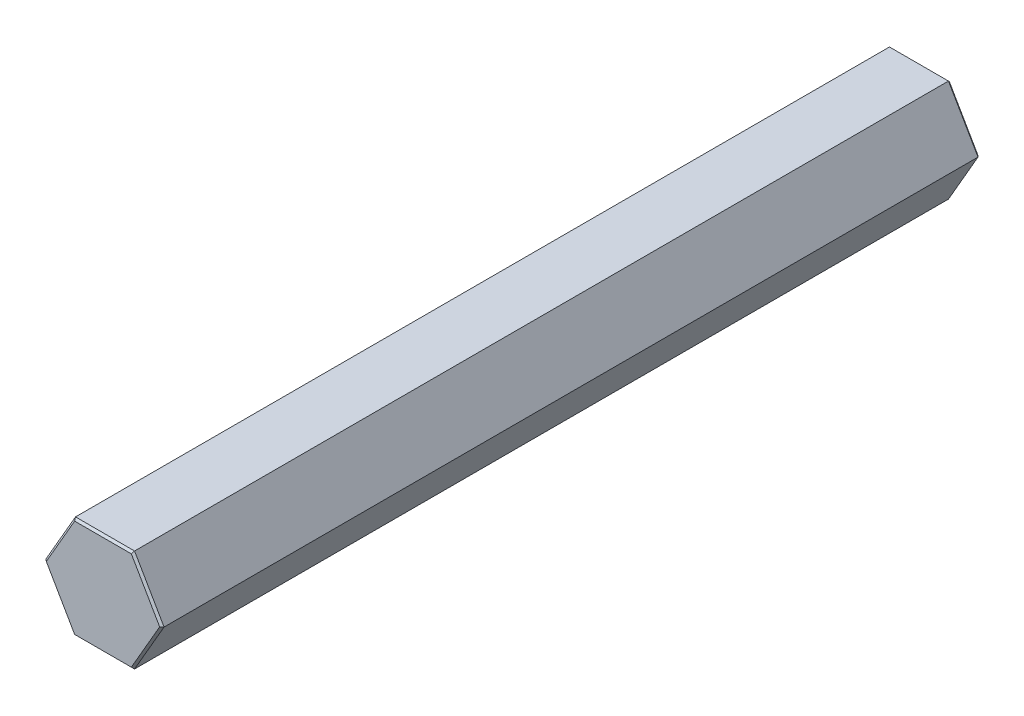
ISO-10303-21;
HEADER;
FILE_DESCRIPTION(('STEP AP214'),'2;1');
FILE_NAME('part.step','',(''),(''),'','','');
FILE_SCHEMA(('AUTOMOTIVE_DESIGN { 1 0 10303 214 1 1 1 1 }'));
ENDSEC;
DATA;
#1=APPLICATION_CONTEXT('core data for automotive mechanical design processes');
#2=APPLICATION_PROTOCOL_DEFINITION('international standard','automotive_design',2000,#1);
#3=PRODUCT_CONTEXT('',#1,'mechanical');
#4=PRODUCT('Part','Part','',(#3));
#5=PRODUCT_RELATED_PRODUCT_CATEGORY('part','',(#4));
#6=PRODUCT_DEFINITION_FORMATION('','',#4);
#7=PRODUCT_DEFINITION_CONTEXT('part definition',#1,'design');
#8=PRODUCT_DEFINITION('design','',#6,#7);
#9=PRODUCT_DEFINITION_SHAPE('','',#8);
#10=(LENGTH_UNIT() NAMED_UNIT(*) SI_UNIT(.MILLI.,.METRE.));
#11=(NAMED_UNIT(*) PLANE_ANGLE_UNIT() SI_UNIT($,.RADIAN.));
#12=(NAMED_UNIT(*) SI_UNIT($,.STERADIAN.) SOLID_ANGLE_UNIT());
#13=UNCERTAINTY_MEASURE_WITH_UNIT(LENGTH_MEASURE(1.E-05),#10,'distance_accuracy_value','');
#14=(GEOMETRIC_REPRESENTATION_CONTEXT(3) GLOBAL_UNCERTAINTY_ASSIGNED_CONTEXT((#13)) GLOBAL_UNIT_ASSIGNED_CONTEXT((#10,
#11,#12)) REPRESENTATION_CONTEXT('',''));
#15=CARTESIAN_POINT('',(0.,0.,0.));
#16=DIRECTION('',(0.,0.,1.));
#17=DIRECTION('',(1.,0.,0.));
#18=AXIS2_PLACEMENT_3D('',#15,#16,#17);
#19=CARTESIAN_POINT('',(-7.33234841870824,0.,101.6));
#20=DIRECTION('',(-0.866025403784439,0.5,0.));
#21=DIRECTION('',(-0.5,-0.866025403784439,0.));
#22=AXIS2_PLACEMENT_3D('',#19,#20,#21);
#23=PLANE('',#22);
#24=DIRECTION('',(0.,0.,-1.));
#25=VECTOR('',#24,1.);
#26=CARTESIAN_POINT('',(-3.66617420935412,6.35,101.6));
#27=LINE('',#26,#25);
#28=CARTESIAN_POINT('',(-3.66617420935412,6.35,101.346));
#29=VERTEX_POINT('',#28);
#30=CARTESIAN_POINT('',(-3.66617420935412,6.35,0.254000000000032));
#31=VERTEX_POINT('',#30);
#32=EDGE_CURVE('E158',#29,#31,#27,.T.);
#33=ORIENTED_EDGE('',*,*,#32,.T.);
#34=DIRECTION('',(-0.5,-0.866025403784439,0.));
#35=VECTOR('',#34,1.);
#36=CARTESIAN_POINT('',(-7.33234841870824,0.,0.254000000000032));
#37=LINE('',#36,#35);
#38=CARTESIAN_POINT('',(-7.33234841870824,0.,0.254000000000032));
#39=VERTEX_POINT('',#38);
#40=EDGE_CURVE('E155',#31,#39,#37,.T.);
#41=ORIENTED_EDGE('',*,*,#40,.T.);
#42=DIRECTION('',(0.,0.,-1.));
#43=VECTOR('',#42,1.);
#44=CARTESIAN_POINT('',(-7.33234841870824,0.,101.6));
#45=LINE('',#44,#43);
#46=CARTESIAN_POINT('',(-7.33234841870824,0.,101.346));
#47=VERTEX_POINT('',#46);
#48=EDGE_CURVE('E152',#47,#39,#45,.T.);
#49=ORIENTED_EDGE('',*,*,#48,.F.);
#50=DIRECTION('',(0.5,0.866025403784439,0.));
#51=VECTOR('',#50,1.);
#52=CARTESIAN_POINT('',(-3.66617420935412,6.35,101.346));
#53=LINE('',#52,#51);
#54=EDGE_CURVE('E212',#47,#29,#53,.T.);
#55=ORIENTED_EDGE('',*,*,#54,.T.);
#56=EDGE_LOOP('',(#33,#41,#49,#55));
#57=FACE_BOUND('',#56,.T.);
#58=ADVANCED_FACE('F37',(#57),#23,.T.);
#59=CARTESIAN_POINT('',(-3.66617420935412,-6.35,101.6));
#60=DIRECTION('',(-0.866025403784439,-0.5,0.));
#61=DIRECTION('',(0.5,-0.866025403784439,0.));
#62=AXIS2_PLACEMENT_3D('',#59,#60,#61);
#63=PLANE('',#62);
#64=ORIENTED_EDGE('',*,*,#48,.T.);
#65=DIRECTION('',(0.5,-0.866025403784439,0.));
#66=VECTOR('',#65,1.);
#67=CARTESIAN_POINT('',(-3.66617420935412,-6.35,0.254000000000032));
#68=LINE('',#67,#66);
#69=CARTESIAN_POINT('',(-3.66617420935412,-6.35,0.254000000000032));
#70=VERTEX_POINT('',#69);
#71=EDGE_CURVE('E196',#39,#70,#68,.T.);
#72=ORIENTED_EDGE('',*,*,#71,.T.);
#73=DIRECTION('',(0.,0.,-1.));
#74=VECTOR('',#73,1.);
#75=CARTESIAN_POINT('',(-3.66617420935412,-6.35,101.6));
#76=LINE('',#75,#74);
#77=CARTESIAN_POINT('',(-3.66617420935412,-6.35,101.346));
#78=VERTEX_POINT('',#77);
#79=EDGE_CURVE('E275',#78,#70,#76,.T.);
#80=ORIENTED_EDGE('',*,*,#79,.F.);
#81=DIRECTION('',(-0.5,0.866025403784439,0.));
#82=VECTOR('',#81,1.);
#83=CARTESIAN_POINT('',(-7.33234841870824,0.,101.346));
#84=LINE('',#83,#82);
#85=EDGE_CURVE('E202',#78,#47,#84,.T.);
#86=ORIENTED_EDGE('',*,*,#85,.T.);
#87=EDGE_LOOP('',(#64,#72,#80,#86));
#88=FACE_BOUND('',#87,.T.);
#89=ADVANCED_FACE('F278',(#88),#63,.T.);
#90=CARTESIAN_POINT('',(3.66617420935413,-6.35,101.6));
#91=DIRECTION('',(0.,-1.,0.));
#92=DIRECTION('',(0.,0.,-1.));
#93=AXIS2_PLACEMENT_3D('',#90,#91,#92);
#94=PLANE('',#93);
#95=ORIENTED_EDGE('',*,*,#79,.T.);
#96=DIRECTION('',(1.,0.,0.));
#97=VECTOR('',#96,1.);
#98=CARTESIAN_POINT('',(3.66617420935413,-6.35,0.254000000000032));
#99=LINE('',#98,#97);
#100=CARTESIAN_POINT('',(3.66617420935413,-6.35,0.254000000000032));
#101=VERTEX_POINT('',#100);
#102=EDGE_CURVE('E235',#70,#101,#99,.T.);
#103=ORIENTED_EDGE('',*,*,#102,.T.);
#104=DIRECTION('',(0.,0.,-1.));
#105=VECTOR('',#104,1.);
#106=CARTESIAN_POINT('',(3.66617420935413,-6.35,101.6));
#107=LINE('',#106,#105);
#108=CARTESIAN_POINT('',(3.66617420935413,-6.35,101.346));
#109=VERTEX_POINT('',#108);
#110=EDGE_CURVE('E252',#109,#101,#107,.T.);
#111=ORIENTED_EDGE('',*,*,#110,.F.);
#112=DIRECTION('',(-1.,0.,0.));
#113=VECTOR('',#112,1.);
#114=CARTESIAN_POINT('',(-3.66617420935412,-6.35,101.346));
#115=LINE('',#114,#113);
#116=EDGE_CURVE('E232',#109,#78,#115,.T.);
#117=ORIENTED_EDGE('',*,*,#116,.T.);
#118=EDGE_LOOP('',(#95,#103,#111,#117));
#119=FACE_BOUND('',#118,.T.);
#120=ADVANCED_FACE('F303',(#119),#94,.T.);
#121=CARTESIAN_POINT('',(7.33234841870825,0.,101.6));
#122=DIRECTION('',(0.866025403784439,-0.5,0.));
#123=DIRECTION('',(0.5,0.866025403784439,0.));
#124=AXIS2_PLACEMENT_3D('',#121,#122,#123);
#125=PLANE('',#124);
#126=ORIENTED_EDGE('',*,*,#110,.T.);
#127=DIRECTION('',(0.5,0.866025403784439,0.));
#128=VECTOR('',#127,1.);
#129=CARTESIAN_POINT('',(7.33234841870825,0.,0.254000000000032));
#130=LINE('',#129,#128);
#131=CARTESIAN_POINT('',(7.33234841870825,0.,0.254000000000032));
#132=VERTEX_POINT('',#131);
#133=EDGE_CURVE('E207',#101,#132,#130,.T.);
#134=ORIENTED_EDGE('',*,*,#133,.T.);
#135=DIRECTION('',(0.,0.,-1.));
#136=VECTOR('',#135,1.);
#137=CARTESIAN_POINT('',(7.33234841870825,0.,101.6));
#138=LINE('',#137,#136);
#139=CARTESIAN_POINT('',(7.33234841870825,0.,101.346));
#140=VERTEX_POINT('',#139);
#141=EDGE_CURVE('E251',#140,#132,#138,.T.);
#142=ORIENTED_EDGE('',*,*,#141,.F.);
#143=DIRECTION('',(-0.5,-0.866025403784439,0.));
#144=VECTOR('',#143,1.);
#145=CARTESIAN_POINT('',(3.66617420935413,-6.35,101.346));
#146=LINE('',#145,#144);
#147=EDGE_CURVE('E239',#140,#109,#146,.T.);
#148=ORIENTED_EDGE('',*,*,#147,.T.);
#149=EDGE_LOOP('',(#126,#134,#142,#148));
#150=FACE_BOUND('',#149,.T.);
#151=ADVANCED_FACE('F250',(#150),#125,.T.);
#152=CARTESIAN_POINT('',(3.66617420935413,6.35,101.6));
#153=DIRECTION('',(0.866025403784439,0.5,0.));
#154=DIRECTION('',(-0.5,0.866025403784439,0.));
#155=AXIS2_PLACEMENT_3D('',#152,#153,#154);
#156=PLANE('',#155);
#157=ORIENTED_EDGE('',*,*,#141,.T.);
#158=DIRECTION('',(-0.5,0.866025403784439,0.));
#159=VECTOR('',#158,1.);
#160=CARTESIAN_POINT('',(3.66617420935413,6.35,0.254000000000032));
#161=LINE('',#160,#159);
#162=CARTESIAN_POINT('',(3.66617420935413,6.35,0.254000000000032));
#163=VERTEX_POINT('',#162);
#164=EDGE_CURVE('E204',#132,#163,#161,.T.);
#165=ORIENTED_EDGE('',*,*,#164,.T.);
#166=DIRECTION('',(0.,0.,-1.));
#167=VECTOR('',#166,1.);
#168=CARTESIAN_POINT('',(3.66617420935413,6.35,101.6));
#169=LINE('',#168,#167);
#170=CARTESIAN_POINT('',(3.66617420935413,6.35,101.346));
#171=VERTEX_POINT('',#170);
#172=EDGE_CURVE('E261',#171,#163,#169,.T.);
#173=ORIENTED_EDGE('',*,*,#172,.F.);
#174=DIRECTION('',(0.5,-0.866025403784439,0.));
#175=VECTOR('',#174,1.);
#176=CARTESIAN_POINT('',(7.33234841870825,0.,101.346));
#177=LINE('',#176,#175);
#178=EDGE_CURVE('E201',#171,#140,#177,.T.);
#179=ORIENTED_EDGE('',*,*,#178,.T.);
#180=EDGE_LOOP('',(#157,#165,#173,#179));
#181=FACE_BOUND('',#180,.T.);
#182=ADVANCED_FACE('F257',(#181),#156,.T.);
#183=CARTESIAN_POINT('',(-3.66617420935412,6.35,101.6));
#184=DIRECTION('',(0.,1.,0.));
#185=DIRECTION('',(0.,0.,1.));
#186=AXIS2_PLACEMENT_3D('',#183,#184,#185);
#187=PLANE('',#186);
#188=ORIENTED_EDGE('',*,*,#172,.T.);
#189=DIRECTION('',(-1.,0.,0.));
#190=VECTOR('',#189,1.);
#191=CARTESIAN_POINT('',(-3.66617420935412,6.35,0.254000000000032));
#192=LINE('',#191,#190);
#193=EDGE_CURVE('E217',#163,#31,#192,.T.);
#194=ORIENTED_EDGE('',*,*,#193,.T.);
#195=ORIENTED_EDGE('',*,*,#32,.F.);
#196=DIRECTION('',(1.,0.,0.));
#197=VECTOR('',#196,1.);
#198=CARTESIAN_POINT('',(3.66617420935413,6.35,101.346));
#199=LINE('',#198,#197);
#200=EDGE_CURVE('E215',#29,#171,#199,.T.);
#201=ORIENTED_EDGE('',*,*,#200,.T.);
#202=EDGE_LOOP('',(#188,#194,#195,#201));
#203=FACE_BOUND('',#202,.T.);
#204=ADVANCED_FACE('F283',(#203),#187,.T.);
#205=CARTESIAN_POINT('',(0.,0.,101.6));
#206=DIRECTION('',(0.,0.,-1.));
#207=DIRECTION('',(-1.,0.,0.));
#208=AXIS2_PLACEMENT_3D('',#205,#206,#207);
#209=PLANE('',#208);
#210=DIRECTION('',(-0.5,-0.866025403784439,0.));
#211=VECTOR('',#210,1.);
#212=CARTESIAN_POINT('',(-7.11237796614699,-0.127000000000001,101.6));
#213=LINE('',#212,#211);
#214=CARTESIAN_POINT('',(-3.51952724097995,6.09599999999999,101.6));
#215=VERTEX_POINT('',#214);
#216=CARTESIAN_POINT('',(-7.03905448195991,0.,101.6));
#217=VERTEX_POINT('',#216);
#218=EDGE_CURVE('E62',#215,#217,#213,.T.);
#219=ORIENTED_EDGE('',*,*,#218,.T.);
#220=DIRECTION('',(0.5,-0.866025403784439,0.));
#221=VECTOR('',#220,1.);
#222=CARTESIAN_POINT('',(-3.44620375679287,-6.223,101.6));
#223=LINE('',#222,#221);
#224=CARTESIAN_POINT('',(-3.51952724097995,-6.09599999999999,101.6));
#225=VERTEX_POINT('',#224);
#226=EDGE_CURVE('E11',#217,#225,#223,.T.);
#227=ORIENTED_EDGE('',*,*,#226,.T.);
#228=DIRECTION('',(1.,0.,0.));
#229=VECTOR('',#228,1.);
#230=CARTESIAN_POINT('',(3.66617420935413,-6.09599999999999,101.6));
#231=LINE('',#230,#229);
#232=CARTESIAN_POINT('',(3.51952724097996,-6.09599999999999,101.6));
#233=VERTEX_POINT('',#232);
#234=EDGE_CURVE('E47',#225,#233,#231,.T.);
#235=ORIENTED_EDGE('',*,*,#234,.T.);
#236=DIRECTION('',(0.5,0.866025403784439,0.));
#237=VECTOR('',#236,1.);
#238=CARTESIAN_POINT('',(7.112377966147,0.127000000000007,101.6));
#239=LINE('',#238,#237);
#240=CARTESIAN_POINT('',(7.03905448195991,0.,101.6));
#241=VERTEX_POINT('',#240);
#242=EDGE_CURVE('E223',#233,#241,#239,.T.);
#243=ORIENTED_EDGE('',*,*,#242,.T.);
#244=DIRECTION('',(-0.5,0.866025403784439,0.));
#245=VECTOR('',#244,1.);
#246=CARTESIAN_POINT('',(3.44620375679288,6.223,101.6));
#247=LINE('',#246,#245);
#248=CARTESIAN_POINT('',(3.51952724097996,6.09599999999999,101.6));
#249=VERTEX_POINT('',#248);
#250=EDGE_CURVE('E219',#241,#249,#247,.T.);
#251=ORIENTED_EDGE('',*,*,#250,.T.);
#252=DIRECTION('',(-1.,0.,0.));
#253=VECTOR('',#252,1.);
#254=CARTESIAN_POINT('',(-3.66617420935412,6.09599999999999,101.6));
#255=LINE('',#254,#253);
#256=EDGE_CURVE('E221',#249,#215,#255,.T.);
#257=ORIENTED_EDGE('',*,*,#256,.T.);
#258=EDGE_LOOP('',(#219,#227,#235,#243,#251,#257));
#259=FACE_BOUND('',#258,.T.);
#260=ADVANCED_FACE('F225',(#259),#209,.F.);
#261=CARTESIAN_POINT('',(0.,0.,0.));
#262=DIRECTION('',(0.,0.,-1.));
#263=DIRECTION('',(-1.,0.,0.));
#264=AXIS2_PLACEMENT_3D('',#261,#262,#263);
#265=PLANE('',#264);
#266=DIRECTION('',(-0.5,-0.866025403784439,0.));
#267=VECTOR('',#266,1.);
#268=CARTESIAN_POINT('',(5.27929086146991,-3.04799999999998,0.));
#269=LINE('',#268,#267);
#270=CARTESIAN_POINT('',(7.03905448195988,0.,0.));
#271=VERTEX_POINT('',#270);
#272=CARTESIAN_POINT('',(3.51952724097994,-6.09599999999997,0.));
#273=VERTEX_POINT('',#272);
#274=EDGE_CURVE('E241',#271,#273,#269,.T.);
#275=ORIENTED_EDGE('',*,*,#274,.T.);
#276=DIRECTION('',(-1.,0.,0.));
#277=VECTOR('',#276,1.);
#278=CARTESIAN_POINT('',(0.,-6.09599999999997,0.));
#279=LINE('',#278,#277);
#280=CARTESIAN_POINT('',(-3.51952724097993,-6.09599999999997,0.));
#281=VERTEX_POINT('',#280);
#282=EDGE_CURVE('E236',#273,#281,#279,.T.);
#283=ORIENTED_EDGE('',*,*,#282,.T.);
#284=DIRECTION('',(-0.5,0.866025403784439,0.));
#285=VECTOR('',#284,1.);
#286=CARTESIAN_POINT('',(-5.27929086146991,-3.04799999999998,0.));
#287=LINE('',#286,#285);
#288=CARTESIAN_POINT('',(-7.03905448195987,0.,0.));
#289=VERTEX_POINT('',#288);
#290=EDGE_CURVE('E136',#281,#289,#287,.T.);
#291=ORIENTED_EDGE('',*,*,#290,.T.);
#292=DIRECTION('',(0.5,0.866025403784439,0.));
#293=VECTOR('',#292,1.);
#294=CARTESIAN_POINT('',(-5.27929086146991,3.04799999999998,0.));
#295=LINE('',#294,#293);
#296=CARTESIAN_POINT('',(-3.51952724097994,6.09599999999997,0.));
#297=VERTEX_POINT('',#296);
#298=EDGE_CURVE('E129',#289,#297,#295,.T.);
#299=ORIENTED_EDGE('',*,*,#298,.T.);
#300=DIRECTION('',(1.,0.,0.));
#301=VECTOR('',#300,1.);
#302=CARTESIAN_POINT('',(0.,6.09599999999997,0.));
#303=LINE('',#302,#301);
#304=CARTESIAN_POINT('',(3.51952724097995,6.09599999999997,0.));
#305=VERTEX_POINT('',#304);
#306=EDGE_CURVE('E132',#297,#305,#303,.T.);
#307=ORIENTED_EDGE('',*,*,#306,.T.);
#308=DIRECTION('',(0.5,-0.866025403784439,0.));
#309=VECTOR('',#308,1.);
#310=CARTESIAN_POINT('',(5.27929086146991,3.04799999999998,0.));
#311=LINE('',#310,#309);
#312=EDGE_CURVE('E141',#305,#271,#311,.T.);
#313=ORIENTED_EDGE('',*,*,#312,.T.);
#314=EDGE_LOOP('',(#275,#283,#291,#299,#307,#313));
#315=FACE_BOUND('',#314,.T.);
#316=ADVANCED_FACE('F131',(#315),#265,.T.);
#317=CARTESIAN_POINT('',(0.,6.09599999999997,0.));
#318=DIRECTION('',(0.,-0.707106781186547,0.707106781186547));
#319=DIRECTION('',(1.,0.,0.));
#320=AXIS2_PLACEMENT_3D('',#317,#318,#319);
#321=PLANE('',#320);
#322=DIRECTION('',(-0.377964473009225,0.654653670707978,0.654653670707978));
#323=VECTOR('',#322,1.);
#324=CARTESIAN_POINT('',(-3.01673763512566,5.22514285714283,-0.870857142857133));
#325=LINE('',#324,#323);
#326=EDGE_CURVE('E147',#31,#297,#325,.F.);
#327=ORIENTED_EDGE('',*,*,#326,.F.);
#328=ORIENTED_EDGE('',*,*,#193,.F.);
#329=DIRECTION('',(-0.377964473009227,-0.654653670707977,-0.654653670707977));
#330=VECTOR('',#329,1.);
#331=CARTESIAN_POINT('',(3.01673763512567,5.22514285714283,-0.870857142857139));
#332=LINE('',#331,#330);
#333=EDGE_CURVE('E150',#305,#163,#332,.F.);
#334=ORIENTED_EDGE('',*,*,#333,.F.);
#335=ORIENTED_EDGE('',*,*,#306,.F.);
#336=EDGE_LOOP('',(#327,#328,#334,#335));
#337=FACE_BOUND('',#336,.T.);
#338=ADVANCED_FACE('F145',(#337),#321,.F.);
#339=CARTESIAN_POINT('',(5.27929086146991,3.04799999999999,0.));
#340=DIRECTION('',(-0.612372435695795,-0.353553390593274,0.707106781186547));
#341=DIRECTION('',(0.5,-0.866025403784439,0.));
#342=AXIS2_PLACEMENT_3D('',#339,#340,#341);
#343=PLANE('',#342);
#344=ORIENTED_EDGE('',*,*,#333,.T.);
#345=ORIENTED_EDGE('',*,*,#164,.F.);
#346=DIRECTION('',(-0.755928946018455,0.,-0.654653670707976));
#347=VECTOR('',#346,1.);
#348=CARTESIAN_POINT('',(6.03347527025132,0.,-0.870857142857144));
#349=LINE('',#348,#347);
#350=EDGE_CURVE('E156',#271,#132,#349,.F.);
#351=ORIENTED_EDGE('',*,*,#350,.F.);
#352=ORIENTED_EDGE('',*,*,#312,.F.);
#353=EDGE_LOOP('',(#344,#345,#351,#352));
#354=FACE_BOUND('',#353,.T.);
#355=ADVANCED_FACE('F265',(#354),#343,.F.);
#356=CARTESIAN_POINT('',(-5.27929086146991,3.04799999999998,0.));
#357=DIRECTION('',(0.612372435695795,-0.353553390593274,0.707106781186546));
#358=DIRECTION('',(0.5,0.866025403784439,0.));
#359=AXIS2_PLACEMENT_3D('',#356,#357,#358);
#360=PLANE('',#359);
#361=ORIENTED_EDGE('',*,*,#326,.T.);
#362=ORIENTED_EDGE('',*,*,#298,.F.);
#363=DIRECTION('',(-0.755928946018454,0.,0.654653670707978));
#364=VECTOR('',#363,1.);
#365=CARTESIAN_POINT('',(-6.03347527025132,0.,-0.87085714285714));
#366=LINE('',#365,#364);
#367=EDGE_CURVE('E161',#39,#289,#366,.F.);
#368=ORIENTED_EDGE('',*,*,#367,.F.);
#369=ORIENTED_EDGE('',*,*,#40,.F.);
#370=EDGE_LOOP('',(#361,#362,#368,#369));
#371=FACE_BOUND('',#370,.T.);
#372=ADVANCED_FACE('F154',(#371),#360,.F.);
#373=CARTESIAN_POINT('',(5.27929086146991,-3.04799999999998,0.));
#374=DIRECTION('',(-0.612372435695793,0.353553390593273,0.707106781186549));
#375=DIRECTION('',(-0.5,-0.866025403784439,0.));
#376=AXIS2_PLACEMENT_3D('',#373,#374,#375);
#377=PLANE('',#376);
#378=ORIENTED_EDGE('',*,*,#350,.T.);
#379=ORIENTED_EDGE('',*,*,#133,.F.);
#380=DIRECTION('',(-0.377964473009231,0.654653670707976,-0.654653670707976));
#381=VECTOR('',#380,1.);
#382=CARTESIAN_POINT('',(3.01673763512566,-5.22514285714284,-0.870857142857132));
#383=LINE('',#382,#381);
#384=EDGE_CURVE('E185',#273,#101,#383,.F.);
#385=ORIENTED_EDGE('',*,*,#384,.F.);
#386=ORIENTED_EDGE('',*,*,#274,.F.);
#387=EDGE_LOOP('',(#378,#379,#385,#386));
#388=FACE_BOUND('',#387,.T.);
#389=ADVANCED_FACE('F267',(#388),#377,.F.);
#390=CARTESIAN_POINT('',(-5.27929086146991,-3.04799999999998,0.));
#391=DIRECTION('',(0.612372435695795,0.353553390593274,0.707106781186547));
#392=DIRECTION('',(-0.5,0.866025403784439,0.));
#393=AXIS2_PLACEMENT_3D('',#390,#391,#392);
#394=PLANE('',#393);
#395=ORIENTED_EDGE('',*,*,#367,.T.);
#396=ORIENTED_EDGE('',*,*,#290,.F.);
#397=DIRECTION('',(-0.377964473009227,-0.654653670707977,0.654653670707977));
#398=VECTOR('',#397,1.);
#399=CARTESIAN_POINT('',(-3.01673763512566,-5.22514285714283,-0.87085714285714));
#400=LINE('',#399,#398);
#401=EDGE_CURVE('E180',#70,#281,#400,.F.);
#402=ORIENTED_EDGE('',*,*,#401,.F.);
#403=ORIENTED_EDGE('',*,*,#71,.F.);
#404=EDGE_LOOP('',(#395,#396,#402,#403));
#405=FACE_BOUND('',#404,.T.);
#406=ADVANCED_FACE('F195',(#405),#394,.F.);
#407=CARTESIAN_POINT('',(0.,-6.09599999999997,0.));
#408=DIRECTION('',(0.,0.707106781186547,0.707106781186547));
#409=DIRECTION('',(-1.,0.,0.));
#410=AXIS2_PLACEMENT_3D('',#407,#408,#409);
#411=PLANE('',#410);
#412=ORIENTED_EDGE('',*,*,#384,.T.);
#413=ORIENTED_EDGE('',*,*,#102,.F.);
#414=ORIENTED_EDGE('',*,*,#401,.T.);
#415=ORIENTED_EDGE('',*,*,#282,.F.);
#416=EDGE_LOOP('',(#412,#413,#414,#415));
#417=FACE_BOUND('',#416,.T.);
#418=ADVANCED_FACE('F309',(#417),#411,.F.);
#419=CARTESIAN_POINT('',(3.66617420935413,6.35,101.346));
#420=DIRECTION('',(0.612372435695811,0.353553390593283,0.707106781186529));
#421=DIRECTION('',(-0.5,0.866025403784439,0.));
#422=AXIS2_PLACEMENT_3D('',#419,#420,#421);
#423=PLANE('',#422);
#424=DIRECTION('',(-0.377964473009218,-0.654653670707963,0.654653670707997));
#425=VECTOR('',#424,1.);
#426=CARTESIAN_POINT('',(3.66617420935413,6.35,101.346));
#427=LINE('',#426,#425);
#428=EDGE_CURVE('E173',#249,#171,#427,.F.);
#429=ORIENTED_EDGE('',*,*,#428,.F.);
#430=ORIENTED_EDGE('',*,*,#250,.F.);
#431=DIRECTION('',(0.755928946018438,0.,-0.654653670707996));
#432=VECTOR('',#431,1.);
#433=CARTESIAN_POINT('',(5.23739172764882,0.,103.160285714286));
#434=LINE('',#433,#432);
#435=EDGE_CURVE('E42',#140,#241,#434,.F.);
#436=ORIENTED_EDGE('',*,*,#435,.F.);
#437=ORIENTED_EDGE('',*,*,#178,.F.);
#438=EDGE_LOOP('',(#429,#430,#436,#437));
#439=FACE_BOUND('',#438,.T.);
#440=ADVANCED_FACE('F40',(#439),#423,.T.);
#441=CARTESIAN_POINT('',(7.33234841870825,0.,101.346));
#442=DIRECTION('',(0.612372435695809,-0.353553390593282,0.707106781186531));
#443=DIRECTION('',(0.5,0.866025403784439,0.));
#444=AXIS2_PLACEMENT_3D('',#441,#442,#443);
#445=PLANE('',#444);
#446=ORIENTED_EDGE('',*,*,#435,.T.);
#447=ORIENTED_EDGE('',*,*,#242,.F.);
#448=DIRECTION('',(0.377964473009222,-0.654653670707962,-0.654653670707995));
#449=VECTOR('',#448,1.);
#450=CARTESIAN_POINT('',(2.61869586382442,-4.53571428571438,103.160285714286));
#451=LINE('',#450,#449);
#452=EDGE_CURVE('E171',#109,#233,#451,.F.);
#453=ORIENTED_EDGE('',*,*,#452,.F.);
#454=ORIENTED_EDGE('',*,*,#147,.F.);
#455=EDGE_LOOP('',(#446,#447,#453,#454));
#456=FACE_BOUND('',#455,.T.);
#457=ADVANCED_FACE('F229',(#456),#445,.T.);
#458=CARTESIAN_POINT('',(-3.66617420935412,6.35,101.346));
#459=DIRECTION('',(0.,0.707106781186566,0.707106781186529));
#460=DIRECTION('',(-1.,0.,0.));
#461=AXIS2_PLACEMENT_3D('',#458,#459,#460);
#462=PLANE('',#461);
#463=ORIENTED_EDGE('',*,*,#428,.T.);
#464=ORIENTED_EDGE('',*,*,#200,.F.);
#465=DIRECTION('',(0.377964473009219,-0.654653670707963,0.654653670707996));
#466=VECTOR('',#465,1.);
#467=CARTESIAN_POINT('',(-3.66617420935412,6.35,101.346));
#468=LINE('',#467,#466);
#469=EDGE_CURVE('E168',#215,#29,#468,.F.);
#470=ORIENTED_EDGE('',*,*,#469,.F.);
#471=ORIENTED_EDGE('',*,*,#256,.F.);
#472=EDGE_LOOP('',(#463,#464,#470,#471));
#473=FACE_BOUND('',#472,.T.);
#474=ADVANCED_FACE('F285',(#473),#462,.T.);
#475=CARTESIAN_POINT('',(3.66617420935413,-6.35,101.346));
#476=DIRECTION('',(0.,-0.707106781186566,0.707106781186529));
#477=DIRECTION('',(1.,0.,0.));
#478=AXIS2_PLACEMENT_3D('',#475,#476,#477);
#479=PLANE('',#478);
#480=ORIENTED_EDGE('',*,*,#452,.T.);
#481=ORIENTED_EDGE('',*,*,#234,.F.);
#482=DIRECTION('',(-0.377964473009221,-0.654653670707962,-0.654653670707996));
#483=VECTOR('',#482,1.);
#484=CARTESIAN_POINT('',(-2.6186958638244,-4.53571428571436,103.160285714286));
#485=LINE('',#484,#483);
#486=EDGE_CURVE('E55',#78,#225,#485,.F.);
#487=ORIENTED_EDGE('',*,*,#486,.F.);
#488=ORIENTED_EDGE('',*,*,#116,.F.);
#489=EDGE_LOOP('',(#480,#481,#487,#488));
#490=FACE_BOUND('',#489,.T.);
#491=ADVANCED_FACE('F231',(#490),#479,.T.);
#492=CARTESIAN_POINT('',(-7.33234841870824,0.,101.346));
#493=DIRECTION('',(-0.61237243569581,0.353553390593283,0.707106781186529));
#494=DIRECTION('',(-0.5,-0.866025403784439,0.));
#495=AXIS2_PLACEMENT_3D('',#492,#493,#494);
#496=PLANE('',#495);
#497=ORIENTED_EDGE('',*,*,#469,.T.);
#498=ORIENTED_EDGE('',*,*,#54,.F.);
#499=DIRECTION('',(0.755928946018438,0.,0.654653670707996));
#500=VECTOR('',#499,1.);
#501=CARTESIAN_POINT('',(-7.33234841870824,0.,101.346));
#502=LINE('',#501,#500);
#503=EDGE_CURVE('E165',#217,#47,#502,.F.);
#504=ORIENTED_EDGE('',*,*,#503,.F.);
#505=ORIENTED_EDGE('',*,*,#218,.F.);
#506=EDGE_LOOP('',(#497,#498,#504,#505));
#507=FACE_BOUND('',#506,.T.);
#508=ADVANCED_FACE('F287',(#507),#496,.T.);
#509=CARTESIAN_POINT('',(-3.66617420935412,-6.35,101.346));
#510=DIRECTION('',(-0.612372435695809,-0.353553390593282,0.70710678118653));
#511=DIRECTION('',(0.5,-0.866025403784439,0.));
#512=AXIS2_PLACEMENT_3D('',#509,#510,#511);
#513=PLANE('',#512);
#514=ORIENTED_EDGE('',*,*,#486,.T.);
#515=ORIENTED_EDGE('',*,*,#226,.F.);
#516=ORIENTED_EDGE('',*,*,#503,.T.);
#517=ORIENTED_EDGE('',*,*,#85,.F.);
#518=EDGE_LOOP('',(#514,#515,#516,#517));
#519=FACE_BOUND('',#518,.T.);
#520=ADVANCED_FACE('F289',(#519),#513,.T.);
#521=CLOSED_SHELL('',(#58,#89,#120,#151,#182,#204,#260,#316,#338,#355,#372,#389,#406,#418,#440,
#457,#474,#491,#508,#520));
#522=MANIFOLD_SOLID_BREP('B2',#521);
#523=ADVANCED_BREP_SHAPE_REPRESENTATION('',(#18,#522),#14);
#524=SHAPE_DEFINITION_REPRESENTATION(#9,#523);
ENDSEC;
END-ISO-10303-21;
